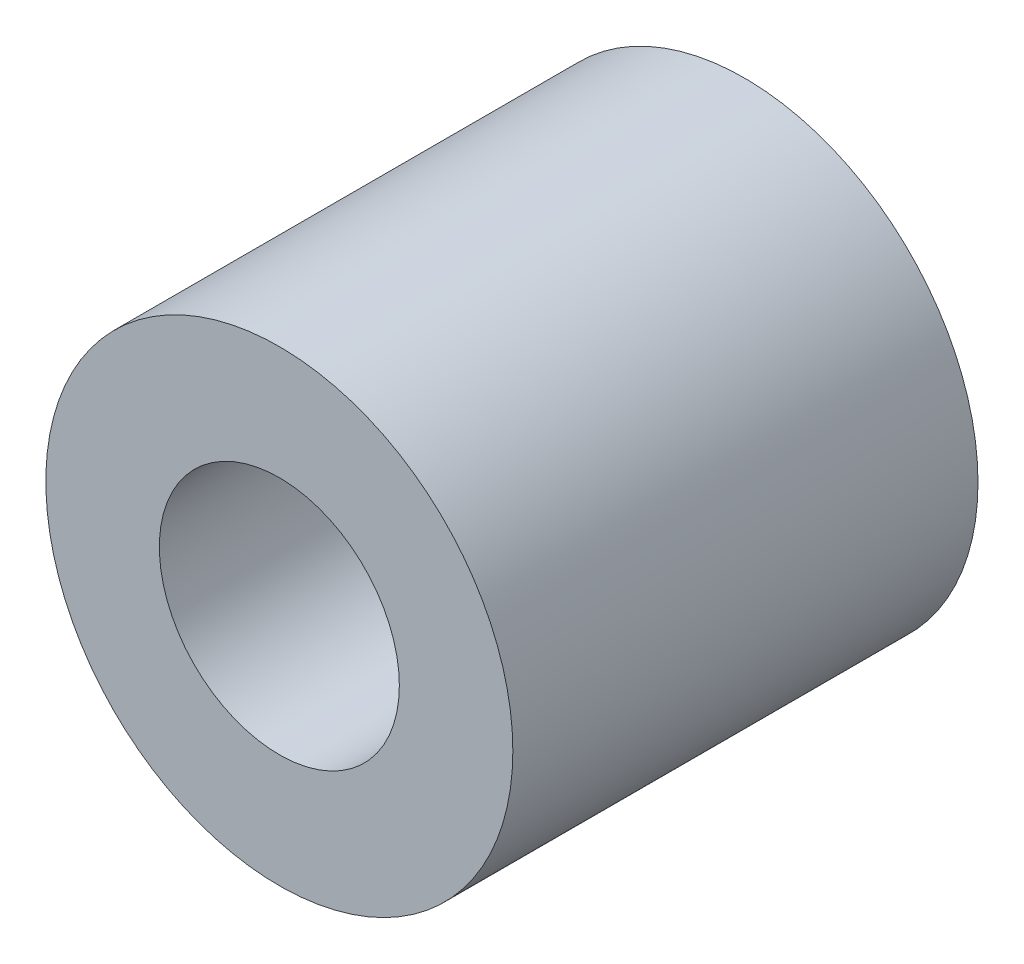
ISO-10303-21;
HEADER;
FILE_DESCRIPTION(('STEP AP214'),'2;1');
FILE_NAME('part.step','',(''),(''),'','','');
FILE_SCHEMA(('AUTOMOTIVE_DESIGN { 1 0 10303 214 1 1 1 1 }'));
ENDSEC;
DATA;
#1=APPLICATION_CONTEXT('core data for automotive mechanical design processes');
#2=APPLICATION_PROTOCOL_DEFINITION('international standard','automotive_design',2000,#1);
#3=PRODUCT_CONTEXT('',#1,'mechanical');
#4=PRODUCT('Part','Part','',(#3));
#5=PRODUCT_RELATED_PRODUCT_CATEGORY('part','',(#4));
#6=PRODUCT_DEFINITION_FORMATION('','',#4);
#7=PRODUCT_DEFINITION_CONTEXT('part definition',#1,'design');
#8=PRODUCT_DEFINITION('design','',#6,#7);
#9=PRODUCT_DEFINITION_SHAPE('','',#8);
#10=(LENGTH_UNIT() NAMED_UNIT(*) SI_UNIT(.MILLI.,.METRE.));
#11=(NAMED_UNIT(*) PLANE_ANGLE_UNIT() SI_UNIT($,.RADIAN.));
#12=(NAMED_UNIT(*) SI_UNIT($,.STERADIAN.) SOLID_ANGLE_UNIT());
#13=UNCERTAINTY_MEASURE_WITH_UNIT(LENGTH_MEASURE(1.E-05),#10,'distance_accuracy_value','');
#14=(GEOMETRIC_REPRESENTATION_CONTEXT(3) GLOBAL_UNCERTAINTY_ASSIGNED_CONTEXT((#13)) GLOBAL_UNIT_ASSIGNED_CONTEXT((#10,
#11,#12)) REPRESENTATION_CONTEXT('',''));
#15=CARTESIAN_POINT('',(0.,0.,0.));
#16=DIRECTION('',(0.,0.,1.));
#17=DIRECTION('',(1.,0.,0.));
#18=AXIS2_PLACEMENT_3D('',#15,#16,#17);
#19=CARTESIAN_POINT('',(0.,0.,3.175));
#20=DIRECTION('',(0.,0.,1.));
#21=DIRECTION('',(1.,0.,0.));
#22=AXIS2_PLACEMENT_3D('',#19,#20,#21);
#23=PLANE('',#22);
#24=CARTESIAN_POINT('',(0.,0.,3.175));
#25=DIRECTION('',(0.,0.,1.));
#26=DIRECTION('',(1.,0.,0.));
#27=AXIS2_PLACEMENT_3D('',#24,#25,#26);
#28=CIRCLE('',#27,3.1877);
#29=CARTESIAN_POINT('',(3.1877,0.,3.175));
#30=VERTEX_POINT('',#29);
#31=EDGE_CURVE('E10',#30,#30,#28,.T.);
#32=ORIENTED_EDGE('',*,*,#31,.T.);
#33=EDGE_LOOP('',(#32));
#34=FACE_BOUND('',#33,.T.);
#35=CARTESIAN_POINT('',(0.,0.,3.175));
#36=DIRECTION('',(0.,0.,1.));
#37=DIRECTION('',(1.,0.,0.));
#38=AXIS2_PLACEMENT_3D('',#35,#36,#37);
#39=CIRCLE('',#38,1.6383);
#40=CARTESIAN_POINT('',(1.6383,0.,3.175));
#41=VERTEX_POINT('',#40);
#42=EDGE_CURVE('E39',#41,#41,#39,.T.);
#43=ORIENTED_EDGE('',*,*,#42,.F.);
#44=EDGE_LOOP('',(#43));
#45=FACE_BOUND('',#44,.T.);
#46=ADVANCED_FACE('F28',(#34,#45),#23,.T.);
#47=CARTESIAN_POINT('',(0.,0.,-3.175));
#48=DIRECTION('',(0.,0.,1.));
#49=DIRECTION('',(1.,0.,0.));
#50=AXIS2_PLACEMENT_3D('',#47,#48,#49);
#51=PLANE('',#50);
#52=CARTESIAN_POINT('',(0.,0.,-3.175));
#53=DIRECTION('',(0.,0.,1.));
#54=DIRECTION('',(1.,0.,0.));
#55=AXIS2_PLACEMENT_3D('',#52,#53,#54);
#56=CIRCLE('',#55,3.1877);
#57=CARTESIAN_POINT('',(3.1877,0.,-3.175));
#58=VERTEX_POINT('',#57);
#59=EDGE_CURVE('E32',#58,#58,#56,.T.);
#60=ORIENTED_EDGE('',*,*,#59,.F.);
#61=EDGE_LOOP('',(#60));
#62=FACE_BOUND('',#61,.T.);
#63=CARTESIAN_POINT('',(0.,0.,-3.175));
#64=DIRECTION('',(0.,0.,1.));
#65=DIRECTION('',(1.,0.,0.));
#66=AXIS2_PLACEMENT_3D('',#63,#64,#65);
#67=CIRCLE('',#66,1.6383);
#68=CARTESIAN_POINT('',(1.6383,0.,-3.175));
#69=VERTEX_POINT('',#68);
#70=EDGE_CURVE('E41',#69,#69,#67,.T.);
#71=ORIENTED_EDGE('',*,*,#70,.T.);
#72=EDGE_LOOP('',(#71));
#73=FACE_BOUND('',#72,.T.);
#74=ADVANCED_FACE('F51',(#62,#73),#51,.F.);
#75=CARTESIAN_POINT('',(0.,0.,3.175));
#76=DIRECTION('',(0.,0.,-1.));
#77=DIRECTION('',(-1.,0.,0.));
#78=AXIS2_PLACEMENT_3D('',#75,#76,#77);
#79=CYLINDRICAL_SURFACE('',#78,3.1877);
#80=ORIENTED_EDGE('',*,*,#31,.F.);
#81=EDGE_LOOP('',(#80));
#82=FACE_BOUND('',#81,.T.);
#83=ORIENTED_EDGE('',*,*,#59,.T.);
#84=EDGE_LOOP('',(#83));
#85=FACE_BOUND('',#84,.T.);
#86=ADVANCED_FACE('F30',(#82,#85),#79,.T.);
#87=CARTESIAN_POINT('',(0.,0.,3.175));
#88=DIRECTION('',(0.,0.,-1.));
#89=DIRECTION('',(-1.,0.,0.));
#90=AXIS2_PLACEMENT_3D('',#87,#88,#89);
#91=CYLINDRICAL_SURFACE('',#90,1.6383);
#92=ORIENTED_EDGE('',*,*,#42,.T.);
#93=EDGE_LOOP('',(#92));
#94=FACE_BOUND('',#93,.T.);
#95=ORIENTED_EDGE('',*,*,#70,.F.);
#96=EDGE_LOOP('',(#95));
#97=FACE_BOUND('',#96,.T.);
#98=ADVANCED_FACE('F47',(#94,#97),#91,.F.);
#99=CLOSED_SHELL('',(#46,#74,#86,#98));
#100=MANIFOLD_SOLID_BREP('B2',#99);
#101=ADVANCED_BREP_SHAPE_REPRESENTATION('',(#18,#100),#14);
#102=SHAPE_DEFINITION_REPRESENTATION(#9,#101);
ENDSEC;
END-ISO-10303-21;
